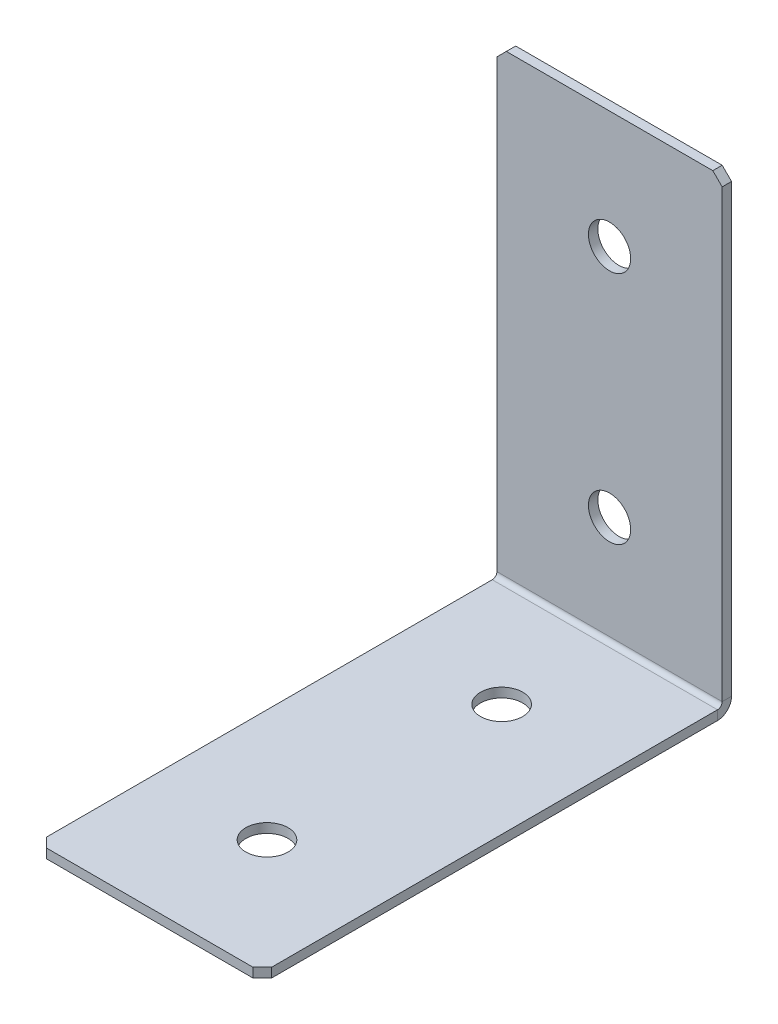
ISO-10303-21;
HEADER;
FILE_DESCRIPTION(('STEP AP214'),'2;1');
FILE_NAME('part.step','',(''),(''),'','','');
FILE_SCHEMA(('AUTOMOTIVE_DESIGN { 1 0 10303 214 1 1 1 1 }'));
ENDSEC;
DATA;
#1=APPLICATION_CONTEXT('core data for automotive mechanical design processes');
#2=APPLICATION_PROTOCOL_DEFINITION('international standard','automotive_design',2000,#1);
#3=PRODUCT_CONTEXT('',#1,'mechanical');
#4=PRODUCT('Part','Part','',(#3));
#5=PRODUCT_RELATED_PRODUCT_CATEGORY('part','',(#4));
#6=PRODUCT_DEFINITION_FORMATION('','',#4);
#7=PRODUCT_DEFINITION_CONTEXT('part definition',#1,'design');
#8=PRODUCT_DEFINITION('design','',#6,#7);
#9=PRODUCT_DEFINITION_SHAPE('','',#8);
#10=(LENGTH_UNIT() NAMED_UNIT(*) SI_UNIT(.MILLI.,.METRE.));
#11=(NAMED_UNIT(*) PLANE_ANGLE_UNIT() SI_UNIT($,.RADIAN.));
#12=(NAMED_UNIT(*) SI_UNIT($,.STERADIAN.) SOLID_ANGLE_UNIT());
#13=UNCERTAINTY_MEASURE_WITH_UNIT(LENGTH_MEASURE(1.E-05),#10,'distance_accuracy_value','');
#14=(GEOMETRIC_REPRESENTATION_CONTEXT(3) GLOBAL_UNCERTAINTY_ASSIGNED_CONTEXT((#13)) GLOBAL_UNIT_ASSIGNED_CONTEXT((#10,
#11,#12)) REPRESENTATION_CONTEXT('',''));
#15=CARTESIAN_POINT('',(0.,0.,0.));
#16=DIRECTION('',(0.,0.,1.));
#17=DIRECTION('',(1.,0.,0.));
#18=AXIS2_PLACEMENT_3D('',#15,#16,#17);
#19=CARTESIAN_POINT('',(24.,0.,2.));
#20=DIRECTION('',(-1.,0.,0.));
#21=DIRECTION('',(0.,1.,0.));
#22=AXIS2_PLACEMENT_3D('',#19,#20,#21);
#23=PLANE('',#22);
#24=DIRECTION('',(0.,1.,0.));
#25=VECTOR('',#24,1.);
#26=CARTESIAN_POINT('',(24.,0.,0.));
#27=LINE('',#26,#25);
#28=CARTESIAN_POINT('',(24.,3.,0.));
#29=VERTEX_POINT('',#28);
#30=CARTESIAN_POINT('',(24.,98.,0.));
#31=VERTEX_POINT('',#30);
#32=EDGE_CURVE('E265',#29,#31,#27,.T.);
#33=ORIENTED_EDGE('',*,*,#32,.T.);
#34=DIRECTION('',(0.,0.,-1.));
#35=VECTOR('',#34,1.);
#36=CARTESIAN_POINT('',(24.,98.,2.));
#37=LINE('',#36,#35);
#38=CARTESIAN_POINT('',(24.,98.,2.));
#39=VERTEX_POINT('',#38);
#40=EDGE_CURVE('E295',#31,#39,#37,.F.);
#41=ORIENTED_EDGE('',*,*,#40,.T.);
#42=DIRECTION('',(0.,1.,0.));
#43=VECTOR('',#42,1.);
#44=CARTESIAN_POINT('',(24.,0.,2.));
#45=LINE('',#44,#43);
#46=CARTESIAN_POINT('',(24.,3.,2.));
#47=VERTEX_POINT('',#46);
#48=EDGE_CURVE('E253',#47,#39,#45,.T.);
#49=ORIENTED_EDGE('',*,*,#48,.F.);
#50=DIRECTION('',(0.,0.,-1.));
#51=VECTOR('',#50,1.);
#52=CARTESIAN_POINT('',(24.,3.,2.));
#53=LINE('',#52,#51);
#54=EDGE_CURVE('E232',#47,#29,#53,.T.);
#55=ORIENTED_EDGE('',*,*,#54,.T.);
#56=EDGE_LOOP('',(#33,#41,#49,#55));
#57=FACE_BOUND('',#56,.T.);
#58=ADVANCED_FACE('F70',(#57),#23,.F.);
#59=CARTESIAN_POINT('',(0.,0.,2.));
#60=DIRECTION('',(0.,0.,-1.));
#61=DIRECTION('',(-1.,0.,0.));
#62=AXIS2_PLACEMENT_3D('',#59,#60,#61);
#63=PLANE('',#62);
#64=CARTESIAN_POINT('',(0.,25.,2.));
#65=DIRECTION('',(0.,0.,1.));
#66=DIRECTION('',(1.,0.,0.));
#67=AXIS2_PLACEMENT_3D('',#64,#65,#66);
#68=CIRCLE('',#67,4.5);
#69=CARTESIAN_POINT('',(4.5,25.,2.));
#70=VERTEX_POINT('',#69);
#71=EDGE_CURVE('E672',#70,#70,#68,.T.);
#72=ORIENTED_EDGE('',*,*,#71,.F.);
#73=EDGE_LOOP('',(#72));
#74=FACE_BOUND('',#73,.T.);
#75=CARTESIAN_POINT('',(0.,75.,2.));
#76=DIRECTION('',(0.,0.,1.));
#77=DIRECTION('',(1.,0.,0.));
#78=AXIS2_PLACEMENT_3D('',#75,#76,#77);
#79=CIRCLE('',#78,4.5);
#80=CARTESIAN_POINT('',(4.5,75.,2.));
#81=VERTEX_POINT('',#80);
#82=EDGE_CURVE('E664',#81,#81,#79,.T.);
#83=ORIENTED_EDGE('',*,*,#82,.F.);
#84=EDGE_LOOP('',(#83));
#85=FACE_BOUND('',#84,.T.);
#86=ORIENTED_EDGE('',*,*,#48,.T.);
#87=DIRECTION('',(0.707106781186552,-0.707106781186543,0.));
#88=VECTOR('',#87,1.);
#89=CARTESIAN_POINT('',(24.,98.,2.));
#90=LINE('',#89,#88);
#91=CARTESIAN_POINT('',(22.,100.,2.));
#92=VERTEX_POINT('',#91);
#93=EDGE_CURVE('E302',#39,#92,#90,.F.);
#94=ORIENTED_EDGE('',*,*,#93,.T.);
#95=DIRECTION('',(-1.,0.,0.));
#96=VECTOR('',#95,1.);
#97=CARTESIAN_POINT('',(-24.,100.,2.));
#98=LINE('',#97,#96);
#99=CARTESIAN_POINT('',(-22.,100.,2.));
#100=VERTEX_POINT('',#99);
#101=EDGE_CURVE('E258',#92,#100,#98,.T.);
#102=ORIENTED_EDGE('',*,*,#101,.T.);
#103=DIRECTION('',(0.707106781186548,0.707106781186548,0.));
#104=VECTOR('',#103,1.);
#105=CARTESIAN_POINT('',(-22.,100.,2.));
#106=LINE('',#105,#104);
#107=CARTESIAN_POINT('',(-24.,98.,2.));
#108=VERTEX_POINT('',#107);
#109=EDGE_CURVE('E299',#100,#108,#106,.F.);
#110=ORIENTED_EDGE('',*,*,#109,.T.);
#111=DIRECTION('',(0.,-1.,0.));
#112=VECTOR('',#111,1.);
#113=CARTESIAN_POINT('',(-24.,0.,2.));
#114=LINE('',#113,#112);
#115=CARTESIAN_POINT('',(-24.,3.,2.));
#116=VERTEX_POINT('',#115);
#117=EDGE_CURVE('E250',#108,#116,#114,.T.);
#118=ORIENTED_EDGE('',*,*,#117,.T.);
#119=DIRECTION('',(1.,0.,0.));
#120=VECTOR('',#119,1.);
#121=CARTESIAN_POINT('',(24.,3.,2.));
#122=LINE('',#121,#120);
#123=EDGE_CURVE('E237',#47,#116,#122,.F.);
#124=ORIENTED_EDGE('',*,*,#123,.F.);
#125=EDGE_LOOP('',(#86,#94,#102,#110,#118,#124));
#126=FACE_BOUND('',#125,.T.);
#127=ADVANCED_FACE('F326',(#74,#85,#126),#63,.F.);
#128=CARTESIAN_POINT('',(0.,0.,0.));
#129=DIRECTION('',(0.,0.,-1.));
#130=DIRECTION('',(-1.,0.,0.));
#131=AXIS2_PLACEMENT_3D('',#128,#129,#130);
#132=PLANE('',#131);
#133=CARTESIAN_POINT('',(0.,25.,0.));
#134=DIRECTION('',(0.,0.,-1.));
#135=DIRECTION('',(-1.,0.,0.));
#136=AXIS2_PLACEMENT_3D('',#133,#134,#135);
#137=CIRCLE('',#136,4.5);
#138=CARTESIAN_POINT('',(-4.5,25.,0.));
#139=VERTEX_POINT('',#138);
#140=EDGE_CURVE('E659',#139,#139,#137,.T.);
#141=ORIENTED_EDGE('',*,*,#140,.F.);
#142=EDGE_LOOP('',(#141));
#143=FACE_BOUND('',#142,.T.);
#144=CARTESIAN_POINT('',(0.,75.,0.));
#145=DIRECTION('',(0.,0.,-1.));
#146=DIRECTION('',(-1.,0.,0.));
#147=AXIS2_PLACEMENT_3D('',#144,#145,#146);
#148=CIRCLE('',#147,4.5);
#149=CARTESIAN_POINT('',(-4.5,75.,0.));
#150=VERTEX_POINT('',#149);
#151=EDGE_CURVE('E227',#150,#150,#148,.T.);
#152=ORIENTED_EDGE('',*,*,#151,.F.);
#153=EDGE_LOOP('',(#152));
#154=FACE_BOUND('',#153,.T.);
#155=DIRECTION('',(-1.,0.,0.));
#156=VECTOR('',#155,1.);
#157=CARTESIAN_POINT('',(0.,100.,0.));
#158=LINE('',#157,#156);
#159=CARTESIAN_POINT('',(22.,100.,0.));
#160=VERTEX_POINT('',#159);
#161=CARTESIAN_POINT('',(-22.,100.,0.));
#162=VERTEX_POINT('',#161);
#163=EDGE_CURVE('E254',#160,#162,#158,.T.);
#164=ORIENTED_EDGE('',*,*,#163,.F.);
#165=DIRECTION('',(-0.707106781186552,0.707106781186543,0.));
#166=VECTOR('',#165,1.);
#167=CARTESIAN_POINT('',(60.9999999999998,61.0000000000007,0.));
#168=LINE('',#167,#166);
#169=EDGE_CURVE('E80',#160,#31,#168,.F.);
#170=ORIENTED_EDGE('',*,*,#169,.T.);
#171=ORIENTED_EDGE('',*,*,#32,.F.);
#172=DIRECTION('',(1.,0.,0.));
#173=VECTOR('',#172,1.);
#174=CARTESIAN_POINT('',(24.,3.,0.));
#175=LINE('',#174,#173);
#176=CARTESIAN_POINT('',(-24.,3.00000000000001,0.));
#177=VERTEX_POINT('',#176);
#178=EDGE_CURVE('E169',#29,#177,#175,.F.);
#179=ORIENTED_EDGE('',*,*,#178,.T.);
#180=DIRECTION('',(0.,1.,0.));
#181=VECTOR('',#180,1.);
#182=CARTESIAN_POINT('',(-24.,0.,0.));
#183=LINE('',#182,#181);
#184=CARTESIAN_POINT('',(-24.,98.,0.));
#185=VERTEX_POINT('',#184);
#186=EDGE_CURVE('E247',#185,#177,#183,.F.);
#187=ORIENTED_EDGE('',*,*,#186,.F.);
#188=DIRECTION('',(-0.707106781186548,-0.707106781186548,0.));
#189=VECTOR('',#188,1.);
#190=CARTESIAN_POINT('',(-61.,61.,0.));
#191=LINE('',#190,#189);
#192=EDGE_CURVE('E92',#185,#162,#191,.F.);
#193=ORIENTED_EDGE('',*,*,#192,.T.);
#194=EDGE_LOOP('',(#164,#170,#171,#179,#187,#193));
#195=FACE_BOUND('',#194,.T.);
#196=ADVANCED_FACE('F317',(#143,#154,#195),#132,.T.);
#197=CARTESIAN_POINT('',(-24.,100.,2.));
#198=DIRECTION('',(0.,-1.,0.));
#199=DIRECTION('',(-1.,0.,0.));
#200=AXIS2_PLACEMENT_3D('',#197,#198,#199);
#201=PLANE('',#200);
#202=ORIENTED_EDGE('',*,*,#101,.F.);
#203=DIRECTION('',(0.,0.,1.));
#204=VECTOR('',#203,1.);
#205=CARTESIAN_POINT('',(22.,100.,2.));
#206=LINE('',#205,#204);
#207=EDGE_CURVE('E309',#92,#160,#206,.F.);
#208=ORIENTED_EDGE('',*,*,#207,.T.);
#209=ORIENTED_EDGE('',*,*,#163,.T.);
#210=DIRECTION('',(0.,0.,-1.));
#211=VECTOR('',#210,1.);
#212=CARTESIAN_POINT('',(-22.,100.,2.));
#213=LINE('',#212,#211);
#214=EDGE_CURVE('E305',#162,#100,#213,.F.);
#215=ORIENTED_EDGE('',*,*,#214,.T.);
#216=EDGE_LOOP('',(#202,#208,#209,#215));
#217=FACE_BOUND('',#216,.T.);
#218=ADVANCED_FACE('F329',(#217),#201,.F.);
#219=CARTESIAN_POINT('',(-24.,0.,2.));
#220=DIRECTION('',(1.,0.,0.));
#221=DIRECTION('',(0.,-1.,0.));
#222=AXIS2_PLACEMENT_3D('',#219,#220,#221);
#223=PLANE('',#222);
#224=ORIENTED_EDGE('',*,*,#117,.F.);
#225=DIRECTION('',(0.,0.,1.));
#226=VECTOR('',#225,1.);
#227=CARTESIAN_POINT('',(-24.,98.,2.));
#228=LINE('',#227,#226);
#229=EDGE_CURVE('E13',#108,#185,#228,.F.);
#230=ORIENTED_EDGE('',*,*,#229,.T.);
#231=ORIENTED_EDGE('',*,*,#186,.T.);
#232=DIRECTION('',(0.,0.,-1.));
#233=VECTOR('',#232,1.);
#234=CARTESIAN_POINT('',(-24.,3.,2.));
#235=LINE('',#234,#233);
#236=EDGE_CURVE('E243',#116,#177,#235,.T.);
#237=ORIENTED_EDGE('',*,*,#236,.F.);
#238=EDGE_LOOP('',(#224,#230,#231,#237));
#239=FACE_BOUND('',#238,.T.);
#240=ADVANCED_FACE('F333',(#239),#223,.F.);
#241=CARTESIAN_POINT('',(-24.,3.,3.));
#242=DIRECTION('',(-1.,0.,0.));
#243=DIRECTION('',(0.,0.,1.));
#244=AXIS2_PLACEMENT_3D('',#241,#242,#243);
#245=PLANE('',#244);
#246=DIRECTION('',(0.,1.,0.));
#247=VECTOR('',#246,1.);
#248=CARTESIAN_POINT('',(-24.,0.,2.99999999999999));
#249=LINE('',#248,#247);
#250=CARTESIAN_POINT('',(-24.,2.,3.));
#251=VERTEX_POINT('',#250);
#252=CARTESIAN_POINT('',(-24.,0.,2.99999999999999));
#253=VERTEX_POINT('',#252);
#254=EDGE_CURVE('E223',#251,#253,#249,.F.);
#255=ORIENTED_EDGE('',*,*,#254,.F.);
#256=CARTESIAN_POINT('',(-24.,3.,3.));
#257=DIRECTION('',(1.,0.,0.));
#258=DIRECTION('',(0.,0.,-1.));
#259=AXIS2_PLACEMENT_3D('',#256,#257,#258);
#260=CIRCLE('',#259,1.);
#261=EDGE_CURVE('E173',#116,#251,#260,.F.);
#262=ORIENTED_EDGE('',*,*,#261,.F.);
#263=ORIENTED_EDGE('',*,*,#236,.T.);
#264=CARTESIAN_POINT('',(-24.,3.,3.));
#265=DIRECTION('',(1.,0.,0.));
#266=DIRECTION('',(0.,0.,-1.));
#267=AXIS2_PLACEMENT_3D('',#264,#265,#266);
#268=CIRCLE('',#267,3.);
#269=EDGE_CURVE('E230',#177,#253,#268,.F.);
#270=ORIENTED_EDGE('',*,*,#269,.T.);
#271=EDGE_LOOP('',(#255,#262,#263,#270));
#272=FACE_BOUND('',#271,.T.);
#273=ADVANCED_FACE('F337',(#272),#245,.T.);
#274=CARTESIAN_POINT('',(24.,3.,3.));
#275=DIRECTION('',(-1.,0.,0.));
#276=DIRECTION('',(0.,0.,1.));
#277=AXIS2_PLACEMENT_3D('',#274,#275,#276);
#278=PLANE('',#277);
#279=CARTESIAN_POINT('',(24.,3.,3.));
#280=DIRECTION('',(1.,0.,0.));
#281=DIRECTION('',(0.,0.,-1.));
#282=AXIS2_PLACEMENT_3D('',#279,#280,#281);
#283=CIRCLE('',#282,1.);
#284=CARTESIAN_POINT('',(24.,2.,3.));
#285=VERTEX_POINT('',#284);
#286=EDGE_CURVE('E180',#285,#47,#283,.T.);
#287=ORIENTED_EDGE('',*,*,#286,.F.);
#288=DIRECTION('',(0.,1.,0.));
#289=VECTOR('',#288,1.);
#290=CARTESIAN_POINT('',(24.,2.,3.));
#291=LINE('',#290,#289);
#292=CARTESIAN_POINT('',(24.,0.,2.99999999999999));
#293=VERTEX_POINT('',#292);
#294=EDGE_CURVE('E177',#285,#293,#291,.F.);
#295=ORIENTED_EDGE('',*,*,#294,.T.);
#296=CARTESIAN_POINT('',(24.,3.,3.));
#297=DIRECTION('',(1.,0.,0.));
#298=DIRECTION('',(0.,0.,-1.));
#299=AXIS2_PLACEMENT_3D('',#296,#297,#298);
#300=CIRCLE('',#299,3.);
#301=EDGE_CURVE('E161',#293,#29,#300,.T.);
#302=ORIENTED_EDGE('',*,*,#301,.T.);
#303=ORIENTED_EDGE('',*,*,#54,.F.);
#304=EDGE_LOOP('',(#287,#295,#302,#303));
#305=FACE_BOUND('',#304,.T.);
#306=ADVANCED_FACE('F178',(#305),#278,.F.);
#307=CARTESIAN_POINT('',(24.,3.,3.));
#308=DIRECTION('',(1.,0.,0.));
#309=DIRECTION('',(0.,-1.,0.));
#310=AXIS2_PLACEMENT_3D('',#307,#308,#309);
#311=CYLINDRICAL_SURFACE('',#310,3.);
#312=ORIENTED_EDGE('',*,*,#178,.F.);
#313=ORIENTED_EDGE('',*,*,#301,.F.);
#314=DIRECTION('',(1.,0.,0.));
#315=VECTOR('',#314,1.);
#316=CARTESIAN_POINT('',(-24.,0.,2.99999999999999));
#317=LINE('',#316,#315);
#318=EDGE_CURVE('E166',#293,#253,#317,.F.);
#319=ORIENTED_EDGE('',*,*,#318,.T.);
#320=ORIENTED_EDGE('',*,*,#269,.F.);
#321=EDGE_LOOP('',(#312,#313,#319,#320));
#322=FACE_BOUND('',#321,.T.);
#323=ADVANCED_FACE('F163',(#322),#311,.T.);
#324=CARTESIAN_POINT('',(24.,3.,3.));
#325=DIRECTION('',(1.,0.,0.));
#326=DIRECTION('',(0.,-1.,0.));
#327=AXIS2_PLACEMENT_3D('',#324,#325,#326);
#328=CYLINDRICAL_SURFACE('',#327,1.);
#329=ORIENTED_EDGE('',*,*,#123,.T.);
#330=ORIENTED_EDGE('',*,*,#261,.T.);
#331=DIRECTION('',(1.,0.,0.));
#332=VECTOR('',#331,1.);
#333=CARTESIAN_POINT('',(-24.,2.,3.));
#334=LINE('',#333,#332);
#335=EDGE_CURVE('E186',#251,#285,#334,.T.);
#336=ORIENTED_EDGE('',*,*,#335,.T.);
#337=ORIENTED_EDGE('',*,*,#286,.T.);
#338=EDGE_LOOP('',(#329,#330,#336,#337));
#339=FACE_BOUND('',#338,.T.);
#340=ADVANCED_FACE('F340',(#339),#328,.F.);
#341=CARTESIAN_POINT('',(-24.,0.,1.99999999999999));
#342=DIRECTION('',(1.,0.,0.));
#343=DIRECTION('',(0.,0.,-1.));
#344=AXIS2_PLACEMENT_3D('',#341,#342,#343);
#345=PLANE('',#344);
#346=DIRECTION('',(0.,0.,-1.));
#347=VECTOR('',#346,1.);
#348=CARTESIAN_POINT('',(-24.,0.,0.));
#349=LINE('',#348,#347);
#350=CARTESIAN_POINT('',(-24.,-3.3522627730272E-13,98.));
#351=VERTEX_POINT('',#350);
#352=EDGE_CURVE('E194',#351,#253,#349,.T.);
#353=ORIENTED_EDGE('',*,*,#352,.F.);
#354=DIRECTION('',(0.,1.,0.));
#355=VECTOR('',#354,1.);
#356=CARTESIAN_POINT('',(-24.,-3.35182208528941E-13,98.));
#357=LINE('',#356,#355);
#358=CARTESIAN_POINT('',(-24.,1.99999999999966,98.));
#359=VERTEX_POINT('',#358);
#360=EDGE_CURVE('E291',#351,#359,#357,.T.);
#361=ORIENTED_EDGE('',*,*,#360,.T.);
#362=DIRECTION('',(0.,0.,1.));
#363=VECTOR('',#362,1.);
#364=CARTESIAN_POINT('',(-24.,2.,2.));
#365=LINE('',#364,#363);
#366=EDGE_CURVE('E196',#359,#251,#365,.F.);
#367=ORIENTED_EDGE('',*,*,#366,.T.);
#368=ORIENTED_EDGE('',*,*,#254,.T.);
#369=EDGE_LOOP('',(#353,#361,#367,#368));
#370=FACE_BOUND('',#369,.T.);
#371=ADVANCED_FACE('F357',(#370),#345,.F.);
#372=CARTESIAN_POINT('',(24.,-3.42174205636425E-13,100.));
#373=DIRECTION('',(-1.,0.,0.));
#374=DIRECTION('',(0.,0.,1.));
#375=AXIS2_PLACEMENT_3D('',#372,#373,#374);
#376=PLANE('',#375);
#377=DIRECTION('',(0.,0.,-1.));
#378=VECTOR('',#377,1.);
#379=CARTESIAN_POINT('',(24.,1.99999999999966,100.));
#380=LINE('',#379,#378);
#381=CARTESIAN_POINT('',(24.,1.99999999999966,98.));
#382=VERTEX_POINT('',#381);
#383=EDGE_CURVE('E216',#285,#382,#380,.F.);
#384=ORIENTED_EDGE('',*,*,#383,.T.);
#385=DIRECTION('',(0.,-1.,0.));
#386=VECTOR('',#385,1.);
#387=CARTESIAN_POINT('',(24.,-3.35191242958739E-13,98.));
#388=LINE('',#387,#386);
#389=CARTESIAN_POINT('',(24.,-3.3522627730272E-13,98.));
#390=VERTEX_POINT('',#389);
#391=EDGE_CURVE('E200',#382,#390,#388,.T.);
#392=ORIENTED_EDGE('',*,*,#391,.T.);
#393=DIRECTION('',(0.,0.,1.));
#394=VECTOR('',#393,1.);
#395=CARTESIAN_POINT('',(24.,0.,0.));
#396=LINE('',#395,#394);
#397=EDGE_CURVE('E191',#293,#390,#396,.T.);
#398=ORIENTED_EDGE('',*,*,#397,.F.);
#399=ORIENTED_EDGE('',*,*,#294,.F.);
#400=EDGE_LOOP('',(#384,#392,#398,#399));
#401=FACE_BOUND('',#400,.T.);
#402=ADVANCED_FACE('F198',(#401),#376,.F.);
#403=CARTESIAN_POINT('',(0.,0.,0.));
#404=DIRECTION('',(0.,1.,0.));
#405=DIRECTION('',(0.,0.,1.));
#406=AXIS2_PLACEMENT_3D('',#403,#404,#405);
#407=PLANE('',#406);
#408=CARTESIAN_POINT('',(0.,0.,25.));
#409=DIRECTION('',(0.,1.,0.));
#410=DIRECTION('',(0.,0.,1.));
#411=AXIS2_PLACEMENT_3D('',#408,#409,#410);
#412=CIRCLE('',#411,4.5);
#413=CARTESIAN_POINT('',(0.,0.,29.5));
#414=VERTEX_POINT('',#413);
#415=EDGE_CURVE('E684',#414,#414,#412,.T.);
#416=ORIENTED_EDGE('',*,*,#415,.T.);
#417=EDGE_LOOP('',(#416));
#418=FACE_BOUND('',#417,.T.);
#419=CARTESIAN_POINT('',(0.,-2.55004350968591E-13,75.));
#420=DIRECTION('',(0.,1.,0.));
#421=DIRECTION('',(0.,0.,1.));
#422=AXIS2_PLACEMENT_3D('',#419,#420,#421);
#423=CIRCLE('',#422,4.5);
#424=CARTESIAN_POINT('',(0.,-2.70716016993385E-13,79.5));
#425=VERTEX_POINT('',#424);
#426=EDGE_CURVE('E676',#425,#425,#423,.T.);
#427=ORIENTED_EDGE('',*,*,#426,.T.);
#428=EDGE_LOOP('',(#427));
#429=FACE_BOUND('',#428,.T.);
#430=ORIENTED_EDGE('',*,*,#397,.T.);
#431=DIRECTION('',(0.707106781186548,0.,-0.707106781186548));
#432=VECTOR('',#431,1.);
#433=CARTESIAN_POINT('',(22.,-3.42174205636425E-13,100.));
#434=LINE('',#433,#432);
#435=CARTESIAN_POINT('',(22.,-3.42209239980406E-13,100.));
#436=VERTEX_POINT('',#435);
#437=EDGE_CURVE('E288',#390,#436,#434,.F.);
#438=ORIENTED_EDGE('',*,*,#437,.T.);
#439=DIRECTION('',(-1.,0.,0.));
#440=VECTOR('',#439,1.);
#441=CARTESIAN_POINT('',(0.,-3.42209239980406E-13,100.));
#442=LINE('',#441,#440);
#443=CARTESIAN_POINT('',(-22.,-3.42209239980406E-13,100.));
#444=VERTEX_POINT('',#443);
#445=EDGE_CURVE('E202',#436,#444,#442,.T.);
#446=ORIENTED_EDGE('',*,*,#445,.T.);
#447=DIRECTION('',(0.707106781186552,0.,0.707106781186543));
#448=VECTOR('',#447,1.);
#449=CARTESIAN_POINT('',(-24.,-3.35182208528941E-13,98.));
#450=LINE('',#449,#448);
#451=EDGE_CURVE('E285',#444,#351,#450,.F.);
#452=ORIENTED_EDGE('',*,*,#451,.T.);
#453=ORIENTED_EDGE('',*,*,#352,.T.);
#454=ORIENTED_EDGE('',*,*,#318,.F.);
#455=EDGE_LOOP('',(#430,#438,#446,#452,#453,#454));
#456=FACE_BOUND('',#455,.T.);
#457=ADVANCED_FACE('F190',(#418,#429,#456),#407,.F.);
#458=CARTESIAN_POINT('',(0.,2.00000000000001,0.));
#459=DIRECTION('',(0.,1.,0.));
#460=DIRECTION('',(0.,0.,1.));
#461=AXIS2_PLACEMENT_3D('',#458,#459,#460);
#462=PLANE('',#461);
#463=CARTESIAN_POINT('',(0.,1.99999999999992,25.));
#464=DIRECTION('',(0.,1.,0.));
#465=DIRECTION('',(0.,0.,1.));
#466=AXIS2_PLACEMENT_3D('',#463,#464,#465);
#467=CIRCLE('',#466,4.5);
#468=CARTESIAN_POINT('',(0.,1.9999999999999,29.5));
#469=VERTEX_POINT('',#468);
#470=EDGE_CURVE('E688',#469,#469,#467,.T.);
#471=ORIENTED_EDGE('',*,*,#470,.F.);
#472=EDGE_LOOP('',(#471));
#473=FACE_BOUND('',#472,.T.);
#474=CARTESIAN_POINT('',(0.,1.99999999999975,75.));
#475=DIRECTION('',(0.,1.,0.));
#476=DIRECTION('',(0.,0.,1.));
#477=AXIS2_PLACEMENT_3D('',#474,#475,#476);
#478=CIRCLE('',#477,4.5);
#479=CARTESIAN_POINT('',(0.,1.99999999999973,79.5));
#480=VERTEX_POINT('',#479);
#481=EDGE_CURVE('E680',#480,#480,#478,.T.);
#482=ORIENTED_EDGE('',*,*,#481,.F.);
#483=EDGE_LOOP('',(#482));
#484=FACE_BOUND('',#483,.T.);
#485=DIRECTION('',(1.,0.,0.));
#486=VECTOR('',#485,1.);
#487=CARTESIAN_POINT('',(-24.,1.99999999999966,100.));
#488=LINE('',#487,#486);
#489=CARTESIAN_POINT('',(22.,1.99999999999966,100.));
#490=VERTEX_POINT('',#489);
#491=CARTESIAN_POINT('',(-22.,1.99999999999966,100.));
#492=VERTEX_POINT('',#491);
#493=EDGE_CURVE('E209',#490,#492,#488,.F.);
#494=ORIENTED_EDGE('',*,*,#493,.F.);
#495=DIRECTION('',(-0.707106781186548,0.,0.707106781186548));
#496=VECTOR('',#495,1.);
#497=CARTESIAN_POINT('',(61.,1.99999999999979,61.));
#498=LINE('',#497,#496);
#499=EDGE_CURVE('E280',#490,#382,#498,.F.);
#500=ORIENTED_EDGE('',*,*,#499,.T.);
#501=ORIENTED_EDGE('',*,*,#383,.F.);
#502=ORIENTED_EDGE('',*,*,#335,.F.);
#503=ORIENTED_EDGE('',*,*,#366,.F.);
#504=DIRECTION('',(-0.707106781186552,0.,-0.707106781186543));
#505=VECTOR('',#504,1.);
#506=CARTESIAN_POINT('',(-60.9999999999998,1.99999999999979,61.0000000000007));
#507=LINE('',#506,#505);
#508=EDGE_CURVE('E277',#359,#492,#507,.F.);
#509=ORIENTED_EDGE('',*,*,#508,.T.);
#510=EDGE_LOOP('',(#494,#500,#501,#502,#503,#509));
#511=FACE_BOUND('',#510,.T.);
#512=ADVANCED_FACE('F344',(#473,#484,#511),#462,.T.);
#513=CARTESIAN_POINT('',(-24.,-3.42174205636425E-13,100.));
#514=DIRECTION('',(0.,0.,-1.));
#515=DIRECTION('',(0.,1.,0.));
#516=AXIS2_PLACEMENT_3D('',#513,#514,#515);
#517=PLANE('',#516);
#518=ORIENTED_EDGE('',*,*,#445,.F.);
#519=DIRECTION('',(0.,1.,0.));
#520=VECTOR('',#519,1.);
#521=CARTESIAN_POINT('',(22.,-3.42174205636425E-13,100.));
#522=LINE('',#521,#520);
#523=EDGE_CURVE('E273',#436,#490,#522,.T.);
#524=ORIENTED_EDGE('',*,*,#523,.T.);
#525=ORIENTED_EDGE('',*,*,#493,.T.);
#526=DIRECTION('',(0.,-1.,0.));
#527=VECTOR('',#526,1.);
#528=CARTESIAN_POINT('',(-22.,-3.42174205636425E-13,100.));
#529=LINE('',#528,#527);
#530=EDGE_CURVE('E262',#492,#444,#529,.T.);
#531=ORIENTED_EDGE('',*,*,#530,.T.);
#532=EDGE_LOOP('',(#518,#524,#525,#531));
#533=FACE_BOUND('',#532,.T.);
#534=ADVANCED_FACE('F351',(#533),#517,.F.);
#535=CARTESIAN_POINT('',(0.,75.,2.));
#536=DIRECTION('',(0.,0.,1.));
#537=DIRECTION('',(1.,0.,0.));
#538=AXIS2_PLACEMENT_3D('',#535,#536,#537);
#539=CYLINDRICAL_SURFACE('',#538,4.5);
#540=ORIENTED_EDGE('',*,*,#82,.T.);
#541=EDGE_LOOP('',(#540));
#542=FACE_BOUND('',#541,.T.);
#543=ORIENTED_EDGE('',*,*,#151,.T.);
#544=EDGE_LOOP('',(#543));
#545=FACE_BOUND('',#544,.T.);
#546=ADVANCED_FACE('F435',(#542,#545),#539,.F.);
#547=CARTESIAN_POINT('',(0.,25.,2.));
#548=DIRECTION('',(0.,0.,1.));
#549=DIRECTION('',(1.,0.,0.));
#550=AXIS2_PLACEMENT_3D('',#547,#548,#549);
#551=CYLINDRICAL_SURFACE('',#550,4.5);
#552=ORIENTED_EDGE('',*,*,#71,.T.);
#553=EDGE_LOOP('',(#552));
#554=FACE_BOUND('',#553,.T.);
#555=ORIENTED_EDGE('',*,*,#140,.T.);
#556=EDGE_LOOP('',(#555));
#557=FACE_BOUND('',#556,.T.);
#558=ADVANCED_FACE('F426',(#554,#557),#551,.F.);
#559=CARTESIAN_POINT('',(0.,1.99999999999975,75.));
#560=DIRECTION('',(0.,1.,0.));
#561=DIRECTION('',(0.,0.,1.));
#562=AXIS2_PLACEMENT_3D('',#559,#560,#561);
#563=CYLINDRICAL_SURFACE('',#562,4.5);
#564=ORIENTED_EDGE('',*,*,#426,.F.);
#565=EDGE_LOOP('',(#564));
#566=FACE_BOUND('',#565,.T.);
#567=ORIENTED_EDGE('',*,*,#481,.T.);
#568=EDGE_LOOP('',(#567));
#569=FACE_BOUND('',#568,.T.);
#570=ADVANCED_FACE('F417',(#566,#569),#563,.F.);
#571=CARTESIAN_POINT('',(0.,1.99999999999992,25.));
#572=DIRECTION('',(0.,1.,0.));
#573=DIRECTION('',(0.,0.,1.));
#574=AXIS2_PLACEMENT_3D('',#571,#572,#573);
#575=CYLINDRICAL_SURFACE('',#574,4.5);
#576=ORIENTED_EDGE('',*,*,#415,.F.);
#577=EDGE_LOOP('',(#576));
#578=FACE_BOUND('',#577,.T.);
#579=ORIENTED_EDGE('',*,*,#470,.T.);
#580=EDGE_LOOP('',(#579));
#581=FACE_BOUND('',#580,.T.);
#582=ADVANCED_FACE('F383',(#578,#581),#575,.F.);
#583=CARTESIAN_POINT('',(22.,-3.42174205636425E-13,100.));
#584=DIRECTION('',(-0.707106781186547,0.,-0.707106781186547));
#585=DIRECTION('',(0.,1.,0.));
#586=AXIS2_PLACEMENT_3D('',#583,#584,#585);
#587=PLANE('',#586);
#588=ORIENTED_EDGE('',*,*,#437,.F.);
#589=ORIENTED_EDGE('',*,*,#391,.F.);
#590=ORIENTED_EDGE('',*,*,#499,.F.);
#591=ORIENTED_EDGE('',*,*,#523,.F.);
#592=EDGE_LOOP('',(#588,#589,#590,#591));
#593=FACE_BOUND('',#592,.T.);
#594=ADVANCED_FACE('F346',(#593),#587,.F.);
#595=CARTESIAN_POINT('',(-24.,-3.35182208528941E-13,98.));
#596=DIRECTION('',(0.707106781186543,0.,-0.707106781186552));
#597=DIRECTION('',(0.,1.,0.));
#598=AXIS2_PLACEMENT_3D('',#595,#596,#597);
#599=PLANE('',#598);
#600=ORIENTED_EDGE('',*,*,#451,.F.);
#601=ORIENTED_EDGE('',*,*,#530,.F.);
#602=ORIENTED_EDGE('',*,*,#508,.F.);
#603=ORIENTED_EDGE('',*,*,#360,.F.);
#604=EDGE_LOOP('',(#600,#601,#602,#603));
#605=FACE_BOUND('',#604,.T.);
#606=ADVANCED_FACE('F354',(#605),#599,.F.);
#607=CARTESIAN_POINT('',(24.,98.,2.));
#608=DIRECTION('',(-0.707106781186542,-0.707106781186552,0.));
#609=DIRECTION('',(0.,0.,1.));
#610=AXIS2_PLACEMENT_3D('',#607,#608,#609);
#611=PLANE('',#610);
#612=ORIENTED_EDGE('',*,*,#169,.F.);
#613=ORIENTED_EDGE('',*,*,#207,.F.);
#614=ORIENTED_EDGE('',*,*,#93,.F.);
#615=ORIENTED_EDGE('',*,*,#40,.F.);
#616=EDGE_LOOP('',(#612,#613,#614,#615));
#617=FACE_BOUND('',#616,.T.);
#618=ADVANCED_FACE('F323',(#617),#611,.F.);
#619=CARTESIAN_POINT('',(-22.,100.,2.));
#620=DIRECTION('',(0.707106781186547,-0.707106781186547,0.));
#621=DIRECTION('',(0.,0.,1.));
#622=AXIS2_PLACEMENT_3D('',#619,#620,#621);
#623=PLANE('',#622);
#624=ORIENTED_EDGE('',*,*,#192,.F.);
#625=ORIENTED_EDGE('',*,*,#229,.F.);
#626=ORIENTED_EDGE('',*,*,#109,.F.);
#627=ORIENTED_EDGE('',*,*,#214,.F.);
#628=EDGE_LOOP('',(#624,#625,#626,#627));
#629=FACE_BOUND('',#628,.T.);
#630=ADVANCED_FACE('F73',(#629),#623,.F.);
#631=CLOSED_SHELL('',(#58,#127,#196,#218,#240,#273,#306,#323,#340,#371,#402,#457,#512,#534,#546,
#558,#570,#582,#594,#606,#618,#630));
#632=MANIFOLD_SOLID_BREP('B2',#631);
#633=ADVANCED_BREP_SHAPE_REPRESENTATION('',(#18,#632),#14);
#634=SHAPE_DEFINITION_REPRESENTATION(#9,#633);
ENDSEC;
END-ISO-10303-21;
